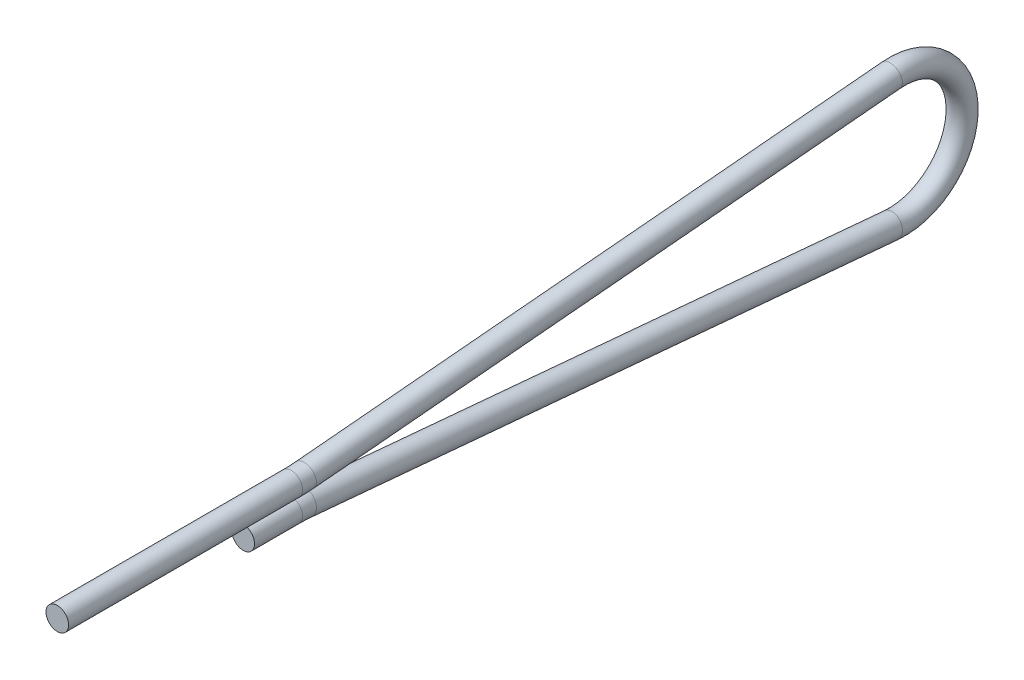
ISO-10303-21;
HEADER;
FILE_DESCRIPTION(('STEP AP214'),'2;1');
FILE_NAME('part.step','',(''),(''),'','','');
FILE_SCHEMA(('AUTOMOTIVE_DESIGN { 1 0 10303 214 1 1 1 1 }'));
ENDSEC;
DATA;
#1=APPLICATION_CONTEXT('core data for automotive mechanical design processes');
#2=APPLICATION_PROTOCOL_DEFINITION('international standard','automotive_design',2000,#1);
#3=PRODUCT_CONTEXT('',#1,'mechanical');
#4=PRODUCT('Part','Part','',(#3));
#5=PRODUCT_RELATED_PRODUCT_CATEGORY('part','',(#4));
#6=PRODUCT_DEFINITION_FORMATION('','',#4);
#7=PRODUCT_DEFINITION_CONTEXT('part definition',#1,'design');
#8=PRODUCT_DEFINITION('design','',#6,#7);
#9=PRODUCT_DEFINITION_SHAPE('','',#8);
#10=(LENGTH_UNIT() NAMED_UNIT(*) SI_UNIT(.MILLI.,.METRE.));
#11=(NAMED_UNIT(*) PLANE_ANGLE_UNIT() SI_UNIT($,.RADIAN.));
#12=(NAMED_UNIT(*) SI_UNIT($,.STERADIAN.) SOLID_ANGLE_UNIT());
#13=UNCERTAINTY_MEASURE_WITH_UNIT(LENGTH_MEASURE(1.E-05),#10,'distance_accuracy_value','');
#14=(GEOMETRIC_REPRESENTATION_CONTEXT(3) GLOBAL_UNCERTAINTY_ASSIGNED_CONTEXT((#13)) GLOBAL_UNIT_ASSIGNED_CONTEXT((#10,
#11,#12)) REPRESENTATION_CONTEXT('',''));
#15=CARTESIAN_POINT('',(0.,0.,0.));
#16=DIRECTION('',(0.,0.,1.));
#17=DIRECTION('',(1.,0.,0.));
#18=AXIS2_PLACEMENT_3D('',#15,#16,#17);
#19=CARTESIAN_POINT('',(0.,-0.736600000000004,39.3642663207381));
#20=DIRECTION('',(0.,0.,1.));
#21=DIRECTION('',(0.,-1.,0.));
#22=AXIS2_PLACEMENT_3D('',#19,#20,#21);
#23=CYLINDRICAL_SURFACE('',#22,0.7366);
#24=CARTESIAN_POINT('',(0.,-0.736600000000004,39.3642663207381));
#25=DIRECTION('',(0.,0.,-1.));
#26=DIRECTION('',(1.,0.,0.));
#27=AXIS2_PLACEMENT_3D('',#24,#25,#26);
#28=CIRCLE('',#27,0.7366);
#29=CARTESIAN_POINT('',(0.,0.,39.3642663207381));
#30=VERTEX_POINT('',#29);
#31=EDGE_CURVE('E38',#30,#30,#28,.T.);
#32=ORIENTED_EDGE('',*,*,#31,.F.);
#33=EDGE_LOOP('',(#32));
#34=FACE_BOUND('',#33,.T.);
#35=CARTESIAN_POINT('',(0.,-0.736599999999995,42.4837638729679));
#36=DIRECTION('',(0.,0.,-1.));
#37=DIRECTION('',(1.,0.,0.));
#38=AXIS2_PLACEMENT_3D('',#35,#36,#37);
#39=CIRCLE('',#38,0.7366);
#40=CARTESIAN_POINT('',(0.7366,-0.736599999999995,42.4837638729679));
#41=VERTEX_POINT('',#40);
#42=EDGE_CURVE('E10',#41,#41,#39,.T.);
#43=ORIENTED_EDGE('',*,*,#42,.T.);
#44=EDGE_LOOP('',(#43));
#45=FACE_BOUND('',#44,.T.);
#46=ADVANCED_FACE('F32',(#34,#45),#23,.T.);
#47=CARTESIAN_POINT('',(0.,-10.7366,39.364266320738));
#48=DIRECTION('',(1.,0.,0.));
#49=DIRECTION('',(0.,0.,-1.));
#50=AXIS2_PLACEMENT_3D('',#47,#48,#49);
#51=TOROIDAL_SURFACE('',#50,10.,0.7366);
#52=CARTESIAN_POINT('',(0.,-0.777200887718891,38.4640611650684));
#53=DIRECTION('',(0.,-0.0900205155669817,-0.99593991122811));
#54=DIRECTION('',(1.,0.,0.));
#55=AXIS2_PLACEMENT_3D('',#52,#53,#54);
#56=CIRCLE('',#55,0.7366);
#57=CARTESIAN_POINT('',(0.,-0.0435915491082631,38.3977520533018));
#58=VERTEX_POINT('',#57);
#59=EDGE_CURVE('E42',#58,#58,#56,.T.);
#60=CARTESIAN_POINT('',(0.,-10.7366,39.364266320738));
#61=DIRECTION('',(1.,0.,0.));
#62=DIRECTION('',(0.,0.,-1.));
#63=AXIS2_PLACEMENT_3D('',#60,#61,#62);
#64=CIRCLE('',#63,10.7366);
#65=EDGE_CURVE('',#58,#30,#64,.T.);
#66=ORIENTED_EDGE('',*,*,#59,.F.);
#67=ORIENTED_EDGE('',*,*,#31,.T.);
#68=ORIENTED_EDGE('',*,*,#65,.T.);
#69=ORIENTED_EDGE('',*,*,#65,.F.);
#70=EDGE_LOOP('',(#66,#68,#67,#69));
#71=FACE_BOUND('',#70,.T.);
#72=ADVANCED_FACE('F94',(#71),#51,.T.);
#73=CARTESIAN_POINT('',(0.,-4.21939902790901,0.381380916251079));
#74=DIRECTION('',(0.,0.0900205155669679,0.995939911228111));
#75=DIRECTION('',(0.,-0.995939911228111,0.0900205155669679));
#76=AXIS2_PLACEMENT_3D('',#73,#74,#75);
#77=CYLINDRICAL_SURFACE('',#76,0.7366);
#78=CARTESIAN_POINT('',(0.,-4.21939902790901,0.381380916251079));
#79=DIRECTION('',(0.,-0.0900205155669817,-0.99593991122811));
#80=DIRECTION('',(1.,0.,0.));
#81=AXIS2_PLACEMENT_3D('',#78,#79,#80);
#82=CIRCLE('',#81,0.7366);
#83=CARTESIAN_POINT('',(0.,-4.95300836651964,0.447690028017718));
#84=VERTEX_POINT('',#83);
#85=EDGE_CURVE('E46',#84,#84,#82,.T.);
#86=ORIENTED_EDGE('',*,*,#85,.F.);
#87=EDGE_LOOP('',(#86));
#88=FACE_BOUND('',#87,.T.);
#89=ORIENTED_EDGE('',*,*,#59,.T.);
#90=EDGE_LOOP('',(#89));
#91=FACE_BOUND('',#90,.T.);
#92=ADVANCED_FACE('F88',(#88,#91),#77,.T.);
#93=CARTESIAN_POINT('',(0.,0.,0.));
#94=DIRECTION('',(-1.,0.,0.));
#95=DIRECTION('',(0.,0.,1.));
#96=AXIS2_PLACEMENT_3D('',#93,#94,#95);
#97=TOROIDAL_SURFACE('',#96,4.23660000000001,0.7366);
#98=CARTESIAN_POINT('',(0.,4.21939902790902,0.381380916251013));
#99=DIRECTION('',(0.,-0.0900205155669679,0.995939911228111));
#100=DIRECTION('',(1.,0.,0.));
#101=AXIS2_PLACEMENT_3D('',#98,#99,#100);
#102=CIRCLE('',#101,0.7366);
#103=CARTESIAN_POINT('',(0.,4.95300836651965,0.447690028017641));
#104=VERTEX_POINT('',#103);
#105=EDGE_CURVE('E51',#104,#104,#102,.T.);
#106=CARTESIAN_POINT('',(0.,0.,0.));
#107=DIRECTION('',(-1.,0.,0.));
#108=DIRECTION('',(0.,0.,1.));
#109=AXIS2_PLACEMENT_3D('',#106,#107,#108);
#110=CIRCLE('',#109,4.97320000000001);
#111=EDGE_CURVE('',#104,#84,#110,.T.);
#112=ORIENTED_EDGE('',*,*,#105,.F.);
#113=ORIENTED_EDGE('',*,*,#85,.T.);
#114=ORIENTED_EDGE('',*,*,#111,.T.);
#115=ORIENTED_EDGE('',*,*,#111,.F.);
#116=EDGE_LOOP('',(#112,#114,#113,#115));
#117=FACE_BOUND('',#116,.T.);
#118=ADVANCED_FACE('F82',(#117),#97,.T.);
#119=CARTESIAN_POINT('',(0.,0.777200887718885,38.4640611650683));
#120=DIRECTION('',(0.,0.0900205155669682,-0.995939911228111));
#121=DIRECTION('',(0.,0.995939911228111,0.0900205155669682));
#122=AXIS2_PLACEMENT_3D('',#119,#120,#121);
#123=CYLINDRICAL_SURFACE('',#122,0.7366);
#124=CARTESIAN_POINT('',(0.,0.777200887718885,38.4640611650683));
#125=DIRECTION('',(0.,-0.0900205155669679,0.995939911228111));
#126=DIRECTION('',(1.,0.,0.));
#127=AXIS2_PLACEMENT_3D('',#124,#125,#126);
#128=CIRCLE('',#127,0.7366);
#129=CARTESIAN_POINT('',(0.,0.0435915491082579,38.3977520533017));
#130=VERTEX_POINT('',#129);
#131=EDGE_CURVE('E54',#130,#130,#128,.T.);
#132=ORIENTED_EDGE('',*,*,#131,.F.);
#133=EDGE_LOOP('',(#132));
#134=FACE_BOUND('',#133,.T.);
#135=ORIENTED_EDGE('',*,*,#105,.T.);
#136=EDGE_LOOP('',(#135));
#137=FACE_BOUND('',#136,.T.);
#138=ADVANCED_FACE('F76',(#134,#137),#123,.T.);
#139=CARTESIAN_POINT('',(0.,10.7366,39.364266320738));
#140=DIRECTION('',(1.,0.,0.));
#141=DIRECTION('',(0.,0.,-1.));
#142=AXIS2_PLACEMENT_3D('',#139,#140,#141);
#143=TOROIDAL_SURFACE('',#142,10.,0.7366);
#144=CARTESIAN_POINT('',(0.,0.736599999999993,39.364266320738));
#145=DIRECTION('',(0.,0.,1.));
#146=DIRECTION('',(1.,0.,0.));
#147=AXIS2_PLACEMENT_3D('',#144,#145,#146);
#148=CIRCLE('',#147,0.7366);
#149=CARTESIAN_POINT('',(0.,0.,39.364266320738));
#150=VERTEX_POINT('',#149);
#151=EDGE_CURVE('E57',#150,#150,#148,.T.);
#152=CARTESIAN_POINT('',(0.,10.7366,39.364266320738));
#153=DIRECTION('',(1.,0.,0.));
#154=DIRECTION('',(0.,0.,-1.));
#155=AXIS2_PLACEMENT_3D('',#152,#153,#154);
#156=CIRCLE('',#155,10.7366);
#157=EDGE_CURVE('',#150,#130,#156,.T.);
#158=ORIENTED_EDGE('',*,*,#151,.F.);
#159=ORIENTED_EDGE('',*,*,#131,.T.);
#160=ORIENTED_EDGE('',*,*,#157,.T.);
#161=ORIENTED_EDGE('',*,*,#157,.F.);
#162=EDGE_LOOP('',(#158,#160,#159,#161));
#163=FACE_BOUND('',#162,.T.);
#164=ADVANCED_FACE('F70',(#163),#143,.T.);
#165=CARTESIAN_POINT('',(0.,0.736599999999995,42.4837638729678));
#166=DIRECTION('',(0.,0.,1.));
#167=DIRECTION('',(1.,0.,0.));
#168=AXIS2_PLACEMENT_3D('',#165,#166,#167);
#169=CYLINDRICAL_SURFACE('',#168,0.7366);
#170=CARTESIAN_POINT('',(0.,0.736599999999995,54.5646002203308));
#171=DIRECTION('',(0.,0.,1.));
#172=DIRECTION('',(1.,0.,0.));
#173=AXIS2_PLACEMENT_3D('',#170,#171,#172);
#174=CIRCLE('',#173,0.7366);
#175=CARTESIAN_POINT('',(0.7366,0.736599999999995,54.5646002203308));
#176=VERTEX_POINT('',#175);
#177=EDGE_CURVE('E60',#176,#176,#174,.T.);
#178=ORIENTED_EDGE('',*,*,#177,.F.);
#179=EDGE_LOOP('',(#178));
#180=FACE_BOUND('',#179,.T.);
#181=ORIENTED_EDGE('',*,*,#151,.T.);
#182=EDGE_LOOP('',(#181));
#183=FACE_BOUND('',#182,.T.);
#184=ADVANCED_FACE('F66',(#180,#183),#169,.T.);
#185=CARTESIAN_POINT('',(0.,-0.736599999999995,42.4837638729679));
#186=DIRECTION('',(0.,0.,-1.));
#187=DIRECTION('',(1.,0.,0.));
#188=AXIS2_PLACEMENT_3D('',#185,#186,#187);
#189=PLANE('',#188);
#190=ORIENTED_EDGE('',*,*,#42,.F.);
#191=EDGE_LOOP('',(#190));
#192=FACE_BOUND('',#191,.T.);
#193=ADVANCED_FACE('F69',(#192),#189,.F.);
#194=CARTESIAN_POINT('',(0.,0.736599999999995,54.5646002203308));
#195=DIRECTION('',(0.,0.,1.));
#196=DIRECTION('',(1.,0.,0.));
#197=AXIS2_PLACEMENT_3D('',#194,#195,#196);
#198=PLANE('',#197);
#199=ORIENTED_EDGE('',*,*,#177,.T.);
#200=EDGE_LOOP('',(#199));
#201=FACE_BOUND('',#200,.T.);
#202=ADVANCED_FACE('F64',(#201),#198,.T.);
#203=CLOSED_SHELL('',(#46,#72,#92,#118,#138,#164,#184,#193,#202));
#204=MANIFOLD_SOLID_BREP('B2',#203);
#205=ADVANCED_BREP_SHAPE_REPRESENTATION('',(#18,#204),#14);
#206=SHAPE_DEFINITION_REPRESENTATION(#9,#205);
ENDSEC;
END-ISO-10303-21;
